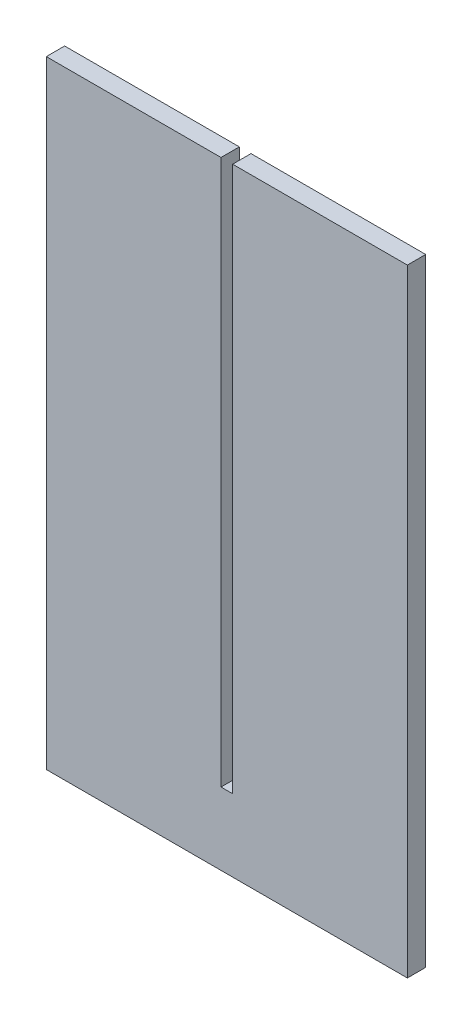
ISO-10303-21;
HEADER;
FILE_DESCRIPTION(('STEP AP214'),'2;1');
FILE_NAME('part.step','',(''),(''),'','','');
FILE_SCHEMA(('AUTOMOTIVE_DESIGN { 1 0 10303 214 1 1 1 1 }'));
ENDSEC;
DATA;
#1=APPLICATION_CONTEXT('core data for automotive mechanical design processes');
#2=APPLICATION_PROTOCOL_DEFINITION('international standard','automotive_design',2000,#1);
#3=PRODUCT_CONTEXT('',#1,'mechanical');
#4=PRODUCT('Part','Part','',(#3));
#5=PRODUCT_RELATED_PRODUCT_CATEGORY('part','',(#4));
#6=PRODUCT_DEFINITION_FORMATION('','',#4);
#7=PRODUCT_DEFINITION_CONTEXT('part definition',#1,'design');
#8=PRODUCT_DEFINITION('design','',#6,#7);
#9=PRODUCT_DEFINITION_SHAPE('','',#8);
#10=(LENGTH_UNIT() NAMED_UNIT(*) SI_UNIT(.MILLI.,.METRE.));
#11=(NAMED_UNIT(*) PLANE_ANGLE_UNIT() SI_UNIT($,.RADIAN.));
#12=(NAMED_UNIT(*) SI_UNIT($,.STERADIAN.) SOLID_ANGLE_UNIT());
#13=UNCERTAINTY_MEASURE_WITH_UNIT(LENGTH_MEASURE(1.E-05),#10,'distance_accuracy_value','');
#14=(GEOMETRIC_REPRESENTATION_CONTEXT(3) GLOBAL_UNCERTAINTY_ASSIGNED_CONTEXT((#13)) GLOBAL_UNIT_ASSIGNED_CONTEXT((#10,
#11,#12)) REPRESENTATION_CONTEXT('',''));
#15=CARTESIAN_POINT('',(0.,0.,0.));
#16=DIRECTION('',(0.,0.,1.));
#17=DIRECTION('',(1.,0.,0.));
#18=AXIS2_PLACEMENT_3D('',#15,#16,#17);
#19=CARTESIAN_POINT('',(199.839551417382,-130.546793579175,296.32270134492));
#20=DIRECTION('',(0.,-1.,0.));
#21=DIRECTION('',(1.,0.,0.));
#22=AXIS2_PLACEMENT_3D('',#19,#20,#21);
#23=PLANE('',#22);
#24=DIRECTION('',(1.,0.,0.));
#25=VECTOR('',#24,1.);
#26=CARTESIAN_POINT('',(199.839551417382,-130.546793579175,296.830971220494));
#27=LINE('',#26,#25);
#28=CARTESIAN_POINT('',(187.839551417382,-130.546793579175,296.830971220494));
#29=VERTEX_POINT('',#28);
#30=CARTESIAN_POINT('',(192.678309363317,-130.546793579175,296.830971220494));
#31=VERTEX_POINT('',#30);
#32=EDGE_CURVE('E112',#29,#31,#27,.T.);
#33=ORIENTED_EDGE('',*,*,#32,.T.);
#34=DIRECTION('',(0.,0.,1.));
#35=VECTOR('',#34,1.);
#36=CARTESIAN_POINT('',(192.678309363317,-130.546793579175,296.32270134492));
#37=LINE('',#36,#35);
#38=CARTESIAN_POINT('',(192.678309363317,-130.546793579175,296.32270134492));
#39=VERTEX_POINT('',#38);
#40=EDGE_CURVE('E32',#39,#31,#37,.T.);
#41=ORIENTED_EDGE('',*,*,#40,.F.);
#42=DIRECTION('',(1.,0.,0.));
#43=VECTOR('',#42,1.);
#44=CARTESIAN_POINT('',(199.839551417382,-130.546793579175,296.32270134492));
#45=LINE('',#44,#43);
#46=CARTESIAN_POINT('',(187.839551417382,-130.546793579175,296.32270134492));
#47=VERTEX_POINT('',#46);
#48=EDGE_CURVE('E131',#47,#39,#45,.T.);
#49=ORIENTED_EDGE('',*,*,#48,.F.);
#50=DIRECTION('',(0.,0.,1.));
#51=VECTOR('',#50,1.);
#52=CARTESIAN_POINT('',(187.839551417382,-130.546793579175,296.32270134492));
#53=LINE('',#52,#51);
#54=EDGE_CURVE('E10',#47,#29,#53,.T.);
#55=ORIENTED_EDGE('',*,*,#54,.T.);
#56=EDGE_LOOP('',(#33,#41,#49,#55));
#57=FACE_BOUND('',#56,.T.);
#58=ADVANCED_FACE('F16',(#57),#23,.F.);
#59=CARTESIAN_POINT('',(187.839551417381,-113.096793579175,296.32270134492));
#60=DIRECTION('',(-1.,0.,0.));
#61=DIRECTION('',(0.,-1.,0.));
#62=AXIS2_PLACEMENT_3D('',#59,#60,#61);
#63=PLANE('',#62);
#64=DIRECTION('',(0.,-1.,0.));
#65=VECTOR('',#64,1.);
#66=CARTESIAN_POINT('',(187.839551417381,-113.096793579175,296.830971220494));
#67=LINE('',#66,#65);
#68=CARTESIAN_POINT('',(187.839551417382,-147.646793579175,296.830971220494));
#69=VERTEX_POINT('',#68);
#70=EDGE_CURVE('E114',#29,#69,#67,.T.);
#71=ORIENTED_EDGE('',*,*,#70,.F.);
#72=ORIENTED_EDGE('',*,*,#54,.F.);
#73=DIRECTION('',(0.,-1.,0.));
#74=VECTOR('',#73,1.);
#75=CARTESIAN_POINT('',(187.839551417381,-113.096793579175,296.32270134492));
#76=LINE('',#75,#74);
#77=CARTESIAN_POINT('',(187.839551417382,-147.646793579175,296.32270134492));
#78=VERTEX_POINT('',#77);
#79=EDGE_CURVE('E141',#47,#78,#76,.T.);
#80=ORIENTED_EDGE('',*,*,#79,.T.);
#81=DIRECTION('',(0.,0.,1.));
#82=VECTOR('',#81,1.);
#83=CARTESIAN_POINT('',(187.839551417382,-147.646793579175,296.32270134492));
#84=LINE('',#83,#82);
#85=EDGE_CURVE('E24',#78,#69,#84,.T.);
#86=ORIENTED_EDGE('',*,*,#85,.T.);
#87=EDGE_LOOP('',(#71,#72,#80,#86));
#88=FACE_BOUND('',#87,.T.);
#89=ADVANCED_FACE('F139',(#88),#63,.T.);
#90=CARTESIAN_POINT('',(199.839551417382,-147.646793579175,296.32270134492));
#91=DIRECTION('',(0.,-1.,0.));
#92=DIRECTION('',(0.,0.,-1.));
#93=AXIS2_PLACEMENT_3D('',#90,#91,#92);
#94=PLANE('',#93);
#95=DIRECTION('',(1.,0.,0.));
#96=VECTOR('',#95,1.);
#97=CARTESIAN_POINT('',(199.839551417382,-147.646793579175,296.830971220494));
#98=LINE('',#97,#96);
#99=CARTESIAN_POINT('',(197.839551417382,-147.646793579175,296.830971220494));
#100=VERTEX_POINT('',#99);
#101=EDGE_CURVE('E117',#69,#100,#98,.T.);
#102=ORIENTED_EDGE('',*,*,#101,.F.);
#103=ORIENTED_EDGE('',*,*,#85,.F.);
#104=DIRECTION('',(1.,0.,0.));
#105=VECTOR('',#104,1.);
#106=CARTESIAN_POINT('',(199.839551417382,-147.646793579175,296.32270134492));
#107=LINE('',#106,#105);
#108=CARTESIAN_POINT('',(197.839551417382,-147.646793579175,296.32270134492));
#109=VERTEX_POINT('',#108);
#110=EDGE_CURVE('E150',#78,#109,#107,.T.);
#111=ORIENTED_EDGE('',*,*,#110,.T.);
#112=DIRECTION('',(0.,0.,1.));
#113=VECTOR('',#112,1.);
#114=CARTESIAN_POINT('',(197.839551417382,-147.646793579175,296.32270134492));
#115=LINE('',#114,#113);
#116=EDGE_CURVE('E137',#109,#100,#115,.T.);
#117=ORIENTED_EDGE('',*,*,#116,.T.);
#118=EDGE_LOOP('',(#102,#103,#111,#117));
#119=FACE_BOUND('',#118,.T.);
#120=ADVANCED_FACE('F145',(#119),#94,.T.);
#121=CARTESIAN_POINT('',(197.839551417382,-113.096793579175,296.32270134492));
#122=DIRECTION('',(-1.,0.,0.));
#123=DIRECTION('',(0.,0.,1.));
#124=AXIS2_PLACEMENT_3D('',#121,#122,#123);
#125=PLANE('',#124);
#126=DIRECTION('',(0.,-1.,0.));
#127=VECTOR('',#126,1.);
#128=CARTESIAN_POINT('',(197.839551417382,-113.096793579175,296.830971220494));
#129=LINE('',#128,#127);
#130=CARTESIAN_POINT('',(197.839551417382,-130.546793579175,296.830971220494));
#131=VERTEX_POINT('',#130);
#132=EDGE_CURVE('E120',#131,#100,#129,.T.);
#133=ORIENTED_EDGE('',*,*,#132,.T.);
#134=ORIENTED_EDGE('',*,*,#116,.F.);
#135=DIRECTION('',(0.,-1.,0.));
#136=VECTOR('',#135,1.);
#137=CARTESIAN_POINT('',(197.839551417382,-113.096793579175,296.32270134492));
#138=LINE('',#137,#136);
#139=CARTESIAN_POINT('',(197.839551417382,-130.546793579175,296.32270134492));
#140=VERTEX_POINT('',#139);
#141=EDGE_CURVE('E154',#140,#109,#138,.T.);
#142=ORIENTED_EDGE('',*,*,#141,.F.);
#143=DIRECTION('',(0.,0.,1.));
#144=VECTOR('',#143,1.);
#145=CARTESIAN_POINT('',(197.839551417382,-130.546793579175,296.32270134492));
#146=LINE('',#145,#144);
#147=EDGE_CURVE('E135',#140,#131,#146,.T.);
#148=ORIENTED_EDGE('',*,*,#147,.T.);
#149=EDGE_LOOP('',(#133,#134,#142,#148));
#150=FACE_BOUND('',#149,.T.);
#151=ADVANCED_FACE('F161',(#150),#125,.F.);
#152=CARTESIAN_POINT('',(199.839551417382,-130.546793579175,296.32270134492));
#153=DIRECTION('',(0.,-1.,0.));
#154=DIRECTION('',(1.,0.,0.));
#155=AXIS2_PLACEMENT_3D('',#152,#153,#154);
#156=PLANE('',#155);
#157=DIRECTION('',(1.,0.,0.));
#158=VECTOR('',#157,1.);
#159=CARTESIAN_POINT('',(199.839551417382,-130.546793579175,296.830971220494));
#160=LINE('',#159,#158);
#161=CARTESIAN_POINT('',(193.000793471446,-130.546793579175,296.830971220494));
#162=VERTEX_POINT('',#161);
#163=EDGE_CURVE('E123',#162,#131,#160,.T.);
#164=ORIENTED_EDGE('',*,*,#163,.T.);
#165=ORIENTED_EDGE('',*,*,#147,.F.);
#166=DIRECTION('',(1.,0.,0.));
#167=VECTOR('',#166,1.);
#168=CARTESIAN_POINT('',(199.839551417382,-130.546793579175,296.32270134492));
#169=LINE('',#168,#167);
#170=CARTESIAN_POINT('',(193.000793471446,-130.546793579175,296.32270134492));
#171=VERTEX_POINT('',#170);
#172=EDGE_CURVE('E103',#171,#140,#169,.T.);
#173=ORIENTED_EDGE('',*,*,#172,.F.);
#174=DIRECTION('',(0.,0.,1.));
#175=VECTOR('',#174,1.);
#176=CARTESIAN_POINT('',(193.000793471446,-130.546793579175,296.32270134492));
#177=LINE('',#176,#175);
#178=EDGE_CURVE('E95',#171,#162,#177,.T.);
#179=ORIENTED_EDGE('',*,*,#178,.T.);
#180=EDGE_LOOP('',(#164,#165,#173,#179));
#181=FACE_BOUND('',#180,.T.);
#182=ADVANCED_FACE('F158',(#181),#156,.F.);
#183=CARTESIAN_POINT('',(193.000793471446,-145.646793579175,296.32270134492));
#184=DIRECTION('',(1.,0.,0.));
#185=DIRECTION('',(0.,1.,0.));
#186=AXIS2_PLACEMENT_3D('',#183,#184,#185);
#187=PLANE('',#186);
#188=DIRECTION('',(0.,1.,0.));
#189=VECTOR('',#188,1.);
#190=CARTESIAN_POINT('',(193.000793471446,-145.646793579175,296.830971220494));
#191=LINE('',#190,#189);
#192=CARTESIAN_POINT('',(193.000793471446,-145.646793579175,296.830971220494));
#193=VERTEX_POINT('',#192);
#194=EDGE_CURVE('E126',#193,#162,#191,.T.);
#195=ORIENTED_EDGE('',*,*,#194,.T.);
#196=ORIENTED_EDGE('',*,*,#178,.F.);
#197=DIRECTION('',(0.,1.,0.));
#198=VECTOR('',#197,1.);
#199=CARTESIAN_POINT('',(193.000793471446,-145.646793579175,296.32270134492));
#200=LINE('',#199,#198);
#201=CARTESIAN_POINT('',(193.000793471446,-145.646793579175,296.32270134492));
#202=VERTEX_POINT('',#201);
#203=EDGE_CURVE('E98',#202,#171,#200,.T.);
#204=ORIENTED_EDGE('',*,*,#203,.F.);
#205=DIRECTION('',(0.,0.,1.));
#206=VECTOR('',#205,1.);
#207=CARTESIAN_POINT('',(193.000793471446,-145.646793579175,296.32270134492));
#208=LINE('',#207,#206);
#209=EDGE_CURVE('E84',#202,#193,#208,.T.);
#210=ORIENTED_EDGE('',*,*,#209,.T.);
#211=EDGE_LOOP('',(#195,#196,#204,#210));
#212=FACE_BOUND('',#211,.T.);
#213=ADVANCED_FACE('F99',(#212),#187,.F.);
#214=CARTESIAN_POINT('',(199.839551417382,-145.646793579175,296.32270134492));
#215=DIRECTION('',(0.,-1.,0.));
#216=DIRECTION('',(1.,0.,0.));
#217=AXIS2_PLACEMENT_3D('',#214,#215,#216);
#218=PLANE('',#217);
#219=DIRECTION('',(1.,0.,0.));
#220=VECTOR('',#219,1.);
#221=CARTESIAN_POINT('',(199.839551417382,-145.646793579175,296.830971220494));
#222=LINE('',#221,#220);
#223=CARTESIAN_POINT('',(192.678309363317,-145.646793579175,296.830971220494));
#224=VERTEX_POINT('',#223);
#225=EDGE_CURVE('E91',#224,#193,#222,.T.);
#226=ORIENTED_EDGE('',*,*,#225,.T.);
#227=ORIENTED_EDGE('',*,*,#209,.F.);
#228=DIRECTION('',(1.,0.,0.));
#229=VECTOR('',#228,1.);
#230=CARTESIAN_POINT('',(199.839551417382,-145.646793579175,296.32270134492));
#231=LINE('',#230,#229);
#232=CARTESIAN_POINT('',(192.678309363317,-145.646793579175,296.32270134492));
#233=VERTEX_POINT('',#232);
#234=EDGE_CURVE('E88',#233,#202,#231,.T.);
#235=ORIENTED_EDGE('',*,*,#234,.F.);
#236=DIRECTION('',(0.,0.,1.));
#237=VECTOR('',#236,1.);
#238=CARTESIAN_POINT('',(192.678309363317,-145.646793579175,296.32270134492));
#239=LINE('',#238,#237);
#240=EDGE_CURVE('E60',#233,#224,#239,.T.);
#241=ORIENTED_EDGE('',*,*,#240,.T.);
#242=EDGE_LOOP('',(#226,#227,#235,#241));
#243=FACE_BOUND('',#242,.T.);
#244=ADVANCED_FACE('F86',(#243),#218,.F.);
#245=CARTESIAN_POINT('',(192.678309363317,-145.646793579175,296.32270134492));
#246=DIRECTION('',(-1.,0.,0.));
#247=DIRECTION('',(0.,-1.,0.));
#248=AXIS2_PLACEMENT_3D('',#245,#246,#247);
#249=PLANE('',#248);
#250=DIRECTION('',(0.,1.,0.));
#251=VECTOR('',#250,1.);
#252=CARTESIAN_POINT('',(192.678309363317,-145.646793579175,296.830971220494));
#253=LINE('',#252,#251);
#254=EDGE_CURVE('E129',#31,#224,#253,.F.);
#255=ORIENTED_EDGE('',*,*,#254,.T.);
#256=ORIENTED_EDGE('',*,*,#240,.F.);
#257=DIRECTION('',(0.,1.,0.));
#258=VECTOR('',#257,1.);
#259=CARTESIAN_POINT('',(192.678309363317,-145.646793579175,296.32270134492));
#260=LINE('',#259,#258);
#261=EDGE_CURVE('E107',#39,#233,#260,.F.);
#262=ORIENTED_EDGE('',*,*,#261,.F.);
#263=ORIENTED_EDGE('',*,*,#40,.T.);
#264=EDGE_LOOP('',(#255,#256,#262,#263));
#265=FACE_BOUND('',#264,.T.);
#266=ADVANCED_FACE('F217',(#265),#249,.F.);
#267=CARTESIAN_POINT('',(199.839551417382,-113.096793579175,296.32270134492));
#268=DIRECTION('',(0.,0.,1.));
#269=DIRECTION('',(0.,-1.,0.));
#270=AXIS2_PLACEMENT_3D('',#267,#268,#269);
#271=PLANE('',#270);
#272=ORIENTED_EDGE('',*,*,#48,.T.);
#273=ORIENTED_EDGE('',*,*,#261,.T.);
#274=ORIENTED_EDGE('',*,*,#234,.T.);
#275=ORIENTED_EDGE('',*,*,#203,.T.);
#276=ORIENTED_EDGE('',*,*,#172,.T.);
#277=ORIENTED_EDGE('',*,*,#141,.T.);
#278=ORIENTED_EDGE('',*,*,#110,.F.);
#279=ORIENTED_EDGE('',*,*,#79,.F.);
#280=EDGE_LOOP('',(#272,#273,#274,#275,#276,#277,#278,#279));
#281=FACE_BOUND('',#280,.T.);
#282=ADVANCED_FACE('F106',(#281),#271,.F.);
#283=CARTESIAN_POINT('',(199.839551417382,-113.096793579175,296.830971220494));
#284=DIRECTION('',(0.,0.,1.));
#285=DIRECTION('',(0.,-1.,0.));
#286=AXIS2_PLACEMENT_3D('',#283,#284,#285);
#287=PLANE('',#286);
#288=ORIENTED_EDGE('',*,*,#32,.F.);
#289=ORIENTED_EDGE('',*,*,#70,.T.);
#290=ORIENTED_EDGE('',*,*,#101,.T.);
#291=ORIENTED_EDGE('',*,*,#132,.F.);
#292=ORIENTED_EDGE('',*,*,#163,.F.);
#293=ORIENTED_EDGE('',*,*,#194,.F.);
#294=ORIENTED_EDGE('',*,*,#225,.F.);
#295=ORIENTED_EDGE('',*,*,#254,.F.);
#296=EDGE_LOOP('',(#288,#289,#290,#291,#292,#293,#294,#295));
#297=FACE_BOUND('',#296,.T.);
#298=ADVANCED_FACE('F148',(#297),#287,.T.);
#299=CLOSED_SHELL('',(#58,#89,#120,#151,#182,#213,#244,#266,#282,#298));
#300=MANIFOLD_SOLID_BREP('B1',#299);
#301=ADVANCED_BREP_SHAPE_REPRESENTATION('',(#18,#300),#14);
#302=SHAPE_DEFINITION_REPRESENTATION(#9,#301);
ENDSEC;
END-ISO-10303-21;
